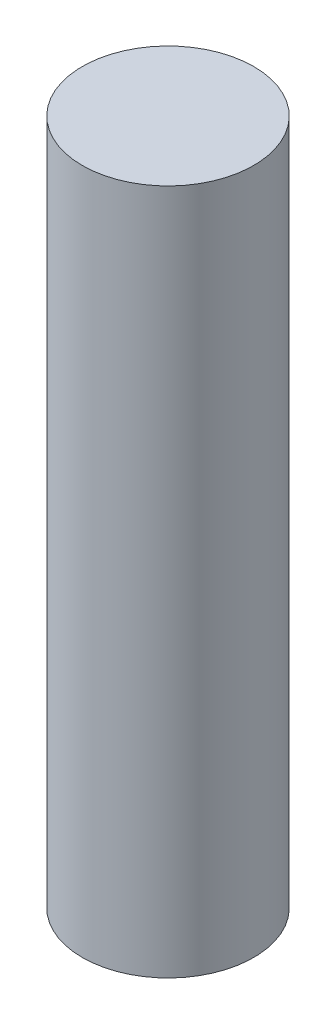
ISO-10303-21;
HEADER;
FILE_DESCRIPTION(('STEP AP214'),'2;1');
FILE_NAME('part.step','',(''),(''),'','','');
FILE_SCHEMA(('AUTOMOTIVE_DESIGN { 1 0 10303 214 1 1 1 1 }'));
ENDSEC;
DATA;
#1=APPLICATION_CONTEXT('core data for automotive mechanical design processes');
#2=APPLICATION_PROTOCOL_DEFINITION('international standard','automotive_design',2000,#1);
#3=PRODUCT_CONTEXT('',#1,'mechanical');
#4=PRODUCT('Part','Part','',(#3));
#5=PRODUCT_RELATED_PRODUCT_CATEGORY('part','',(#4));
#6=PRODUCT_DEFINITION_FORMATION('','',#4);
#7=PRODUCT_DEFINITION_CONTEXT('part definition',#1,'design');
#8=PRODUCT_DEFINITION('design','',#6,#7);
#9=PRODUCT_DEFINITION_SHAPE('','',#8);
#10=(LENGTH_UNIT() NAMED_UNIT(*) SI_UNIT(.MILLI.,.METRE.));
#11=(NAMED_UNIT(*) PLANE_ANGLE_UNIT() SI_UNIT($,.RADIAN.));
#12=(NAMED_UNIT(*) SI_UNIT($,.STERADIAN.) SOLID_ANGLE_UNIT());
#13=UNCERTAINTY_MEASURE_WITH_UNIT(LENGTH_MEASURE(1.E-05),#10,'distance_accuracy_value','');
#14=(GEOMETRIC_REPRESENTATION_CONTEXT(3) GLOBAL_UNCERTAINTY_ASSIGNED_CONTEXT((#13)) GLOBAL_UNIT_ASSIGNED_CONTEXT((#10,
#11,#12)) REPRESENTATION_CONTEXT('',''));
#15=CARTESIAN_POINT('',(0.,0.,0.));
#16=DIRECTION('',(0.,0.,1.));
#17=DIRECTION('',(1.,0.,0.));
#18=AXIS2_PLACEMENT_3D('',#15,#16,#17);
#19=CARTESIAN_POINT('',(0.,50.8,0.));
#20=DIRECTION('',(0.,-1.,0.));
#21=DIRECTION('',(0.,0.,-1.));
#22=AXIS2_PLACEMENT_3D('',#19,#20,#21);
#23=CYLINDRICAL_SURFACE('',#22,6.35);
#24=CARTESIAN_POINT('',(0.,50.8,0.));
#25=DIRECTION('',(0.,1.,0.));
#26=DIRECTION('',(0.,0.,1.));
#27=AXIS2_PLACEMENT_3D('',#24,#25,#26);
#28=CIRCLE('',#27,6.35);
#29=CARTESIAN_POINT('',(0.,50.8,6.35));
#30=VERTEX_POINT('',#29);
#31=EDGE_CURVE('E10',#30,#30,#28,.T.);
#32=ORIENTED_EDGE('',*,*,#31,.F.);
#33=EDGE_LOOP('',(#32));
#34=FACE_BOUND('',#33,.T.);
#35=CARTESIAN_POINT('',(0.,0.,0.));
#36=DIRECTION('',(0.,1.,0.));
#37=DIRECTION('',(0.,0.,1.));
#38=AXIS2_PLACEMENT_3D('',#35,#36,#37);
#39=CIRCLE('',#38,6.35);
#40=CARTESIAN_POINT('',(0.,0.,6.35));
#41=VERTEX_POINT('',#40);
#42=EDGE_CURVE('E40',#41,#41,#39,.T.);
#43=ORIENTED_EDGE('',*,*,#42,.T.);
#44=EDGE_LOOP('',(#43));
#45=FACE_BOUND('',#44,.T.);
#46=ADVANCED_FACE('F37',(#34,#45),#23,.T.);
#47=CARTESIAN_POINT('',(0.,50.8,0.));
#48=DIRECTION('',(0.,1.,0.));
#49=DIRECTION('',(0.,0.,1.));
#50=AXIS2_PLACEMENT_3D('',#47,#48,#49);
#51=PLANE('',#50);
#52=ORIENTED_EDGE('',*,*,#31,.T.);
#53=EDGE_LOOP('',(#52));
#54=FACE_BOUND('',#53,.T.);
#55=ADVANCED_FACE('F54',(#54),#51,.T.);
#56=CARTESIAN_POINT('',(0.,0.,0.));
#57=DIRECTION('',(0.,1.,0.));
#58=DIRECTION('',(0.,0.,1.));
#59=AXIS2_PLACEMENT_3D('',#56,#57,#58);
#60=PLANE('',#59);
#61=ORIENTED_EDGE('',*,*,#42,.F.);
#62=EDGE_LOOP('',(#61));
#63=FACE_BOUND('',#62,.T.);
#64=ADVANCED_FACE('F52',(#63),#60,.F.);
#65=CLOSED_SHELL('',(#46,#55,#64));
#66=MANIFOLD_SOLID_BREP('B2',#65);
#67=ADVANCED_BREP_SHAPE_REPRESENTATION('',(#18,#66),#14);
#68=SHAPE_DEFINITION_REPRESENTATION(#9,#67);
ENDSEC;
END-ISO-10303-21;
